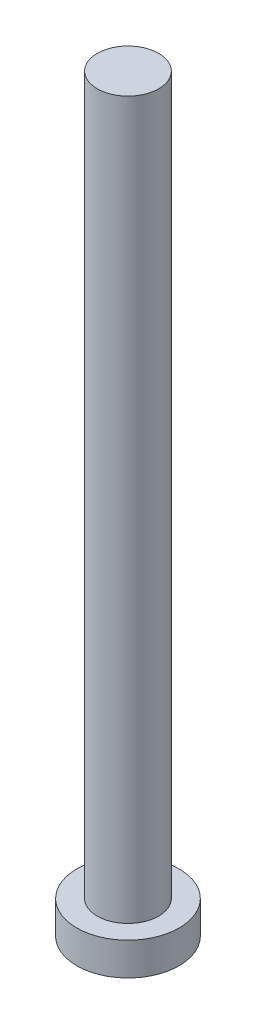
ISO-10303-21;
HEADER;
FILE_DESCRIPTION(('STEP AP214'),'2;1');
FILE_NAME('part.step','',(''),(''),'','','');
FILE_SCHEMA(('AUTOMOTIVE_DESIGN { 1 0 10303 214 1 1 1 1 }'));
ENDSEC;
DATA;
#1=APPLICATION_CONTEXT('core data for automotive mechanical design processes');
#2=APPLICATION_PROTOCOL_DEFINITION('international standard','automotive_design',2000,#1);
#3=PRODUCT_CONTEXT('',#1,'mechanical');
#4=PRODUCT('Part','Part','',(#3));
#5=PRODUCT_RELATED_PRODUCT_CATEGORY('part','',(#4));
#6=PRODUCT_DEFINITION_FORMATION('','',#4);
#7=PRODUCT_DEFINITION_CONTEXT('part definition',#1,'design');
#8=PRODUCT_DEFINITION('design','',#6,#7);
#9=PRODUCT_DEFINITION_SHAPE('','',#8);
#10=(LENGTH_UNIT() NAMED_UNIT(*) SI_UNIT(.MILLI.,.METRE.));
#11=(NAMED_UNIT(*) PLANE_ANGLE_UNIT() SI_UNIT($,.RADIAN.));
#12=(NAMED_UNIT(*) SI_UNIT($,.STERADIAN.) SOLID_ANGLE_UNIT());
#13=UNCERTAINTY_MEASURE_WITH_UNIT(LENGTH_MEASURE(1.E-05),#10,'distance_accuracy_value','');
#14=(GEOMETRIC_REPRESENTATION_CONTEXT(3) GLOBAL_UNCERTAINTY_ASSIGNED_CONTEXT((#13)) GLOBAL_UNIT_ASSIGNED_CONTEXT((#10,
#11,#12)) REPRESENTATION_CONTEXT('',''));
#15=CARTESIAN_POINT('',(0.,0.,0.));
#16=DIRECTION('',(0.,0.,1.));
#17=DIRECTION('',(1.,0.,0.));
#18=AXIS2_PLACEMENT_3D('',#15,#16,#17);
#19=CARTESIAN_POINT('',(0.,0.,0.));
#20=DIRECTION('',(0.,1.,0.));
#21=DIRECTION('',(0.,0.,1.));
#22=AXIS2_PLACEMENT_3D('',#19,#20,#21);
#23=PLANE('',#22);
#24=CARTESIAN_POINT('',(0.,0.,0.));
#25=DIRECTION('',(0.,1.,0.));
#26=DIRECTION('',(0.,0.,1.));
#27=AXIS2_PLACEMENT_3D('',#24,#25,#26);
#28=CIRCLE('',#27,2.5);
#29=CARTESIAN_POINT('',(0.,0.,2.5));
#30=VERTEX_POINT('',#29);
#31=EDGE_CURVE('E39',#30,#30,#28,.T.);
#32=ORIENTED_EDGE('',*,*,#31,.F.);
#33=EDGE_LOOP('',(#32));
#34=FACE_BOUND('',#33,.T.);
#35=CARTESIAN_POINT('',(1.,0.,1.));
#36=DIRECTION('',(0.,1.,0.));
#37=DIRECTION('',(0.,0.,-1.));
#38=AXIS2_PLACEMENT_3D('',#35,#36,#37);
#39=CIRCLE('',#38,0.5);
#40=CARTESIAN_POINT('',(1.,0.,0.5));
#41=VERTEX_POINT('',#40);
#42=CARTESIAN_POINT('',(0.5,0.,1.));
#43=VERTEX_POINT('',#42);
#44=EDGE_CURVE('E186',#41,#43,#39,.T.);
#45=ORIENTED_EDGE('',*,*,#44,.F.);
#46=DIRECTION('',(-1.,0.,0.));
#47=VECTOR('',#46,1.);
#48=CARTESIAN_POINT('',(1.,0.,0.5));
#49=LINE('',#48,#47);
#50=CARTESIAN_POINT('',(1.75,0.,0.5));
#51=VERTEX_POINT('',#50);
#52=EDGE_CURVE('E52',#51,#41,#49,.T.);
#53=ORIENTED_EDGE('',*,*,#52,.F.);
#54=DIRECTION('',(0.,0.,1.));
#55=VECTOR('',#54,1.);
#56=CARTESIAN_POINT('',(1.75,0.,-0.5));
#57=LINE('',#56,#55);
#58=CARTESIAN_POINT('',(1.75,0.,-0.5));
#59=VERTEX_POINT('',#58);
#60=EDGE_CURVE('E225',#59,#51,#57,.T.);
#61=ORIENTED_EDGE('',*,*,#60,.F.);
#62=DIRECTION('',(1.,0.,0.));
#63=VECTOR('',#62,1.);
#64=CARTESIAN_POINT('',(1.,0.,-0.5));
#65=LINE('',#64,#63);
#66=CARTESIAN_POINT('',(1.,0.,-0.5));
#67=VERTEX_POINT('',#66);
#68=EDGE_CURVE('E223',#67,#59,#65,.T.);
#69=ORIENTED_EDGE('',*,*,#68,.F.);
#70=CARTESIAN_POINT('',(1.,0.,-1.));
#71=DIRECTION('',(0.,1.,0.));
#72=DIRECTION('',(0.,0.,-1.));
#73=AXIS2_PLACEMENT_3D('',#70,#71,#72);
#74=CIRCLE('',#73,0.5);
#75=CARTESIAN_POINT('',(0.5,0.,-1.));
#76=VERTEX_POINT('',#75);
#77=EDGE_CURVE('E160',#76,#67,#74,.T.);
#78=ORIENTED_EDGE('',*,*,#77,.F.);
#79=DIRECTION('',(0.,0.,1.));
#80=VECTOR('',#79,1.);
#81=CARTESIAN_POINT('',(0.5,0.,-1.75));
#82=LINE('',#81,#80);
#83=CARTESIAN_POINT('',(0.5,0.,-1.75));
#84=VERTEX_POINT('',#83);
#85=EDGE_CURVE('E219',#84,#76,#82,.T.);
#86=ORIENTED_EDGE('',*,*,#85,.F.);
#87=DIRECTION('',(1.,0.,0.));
#88=VECTOR('',#87,1.);
#89=CARTESIAN_POINT('',(-0.5,0.,-1.75));
#90=LINE('',#89,#88);
#91=CARTESIAN_POINT('',(-0.5,0.,-1.75));
#92=VERTEX_POINT('',#91);
#93=EDGE_CURVE('E216',#92,#84,#90,.T.);
#94=ORIENTED_EDGE('',*,*,#93,.F.);
#95=DIRECTION('',(0.,0.,-1.));
#96=VECTOR('',#95,1.);
#97=CARTESIAN_POINT('',(-0.5,0.,-1.75));
#98=LINE('',#97,#96);
#99=CARTESIAN_POINT('',(-0.5,0.,-1.));
#100=VERTEX_POINT('',#99);
#101=EDGE_CURVE('E213',#100,#92,#98,.T.);
#102=ORIENTED_EDGE('',*,*,#101,.F.);
#103=CARTESIAN_POINT('',(-1.,0.,-1.));
#104=DIRECTION('',(0.,1.,0.));
#105=DIRECTION('',(0.,0.,-1.));
#106=AXIS2_PLACEMENT_3D('',#103,#104,#105);
#107=CIRCLE('',#106,0.5);
#108=CARTESIAN_POINT('',(-1.,0.,-0.5));
#109=VERTEX_POINT('',#108);
#110=EDGE_CURVE('E210',#109,#100,#107,.T.);
#111=ORIENTED_EDGE('',*,*,#110,.F.);
#112=DIRECTION('',(1.,0.,0.));
#113=VECTOR('',#112,1.);
#114=CARTESIAN_POINT('',(-1.75,0.,-0.5));
#115=LINE('',#114,#113);
#116=CARTESIAN_POINT('',(-1.75,0.,-0.5));
#117=VERTEX_POINT('',#116);
#118=EDGE_CURVE('E207',#117,#109,#115,.T.);
#119=ORIENTED_EDGE('',*,*,#118,.F.);
#120=DIRECTION('',(0.,0.,-1.));
#121=VECTOR('',#120,1.);
#122=CARTESIAN_POINT('',(-1.75,0.,-0.5));
#123=LINE('',#122,#121);
#124=CARTESIAN_POINT('',(-1.75,0.,0.5));
#125=VERTEX_POINT('',#124);
#126=EDGE_CURVE('E204',#125,#117,#123,.T.);
#127=ORIENTED_EDGE('',*,*,#126,.F.);
#128=DIRECTION('',(-1.,0.,0.));
#129=VECTOR('',#128,1.);
#130=CARTESIAN_POINT('',(-1.75,0.,0.5));
#131=LINE('',#130,#129);
#132=CARTESIAN_POINT('',(-1.,0.,0.5));
#133=VERTEX_POINT('',#132);
#134=EDGE_CURVE('E201',#133,#125,#131,.T.);
#135=ORIENTED_EDGE('',*,*,#134,.F.);
#136=CARTESIAN_POINT('',(-1.,0.,1.));
#137=DIRECTION('',(0.,1.,0.));
#138=DIRECTION('',(0.,0.,1.));
#139=AXIS2_PLACEMENT_3D('',#136,#137,#138);
#140=CIRCLE('',#139,0.5);
#141=CARTESIAN_POINT('',(-0.5,0.,1.));
#142=VERTEX_POINT('',#141);
#143=EDGE_CURVE('E198',#142,#133,#140,.T.);
#144=ORIENTED_EDGE('',*,*,#143,.F.);
#145=DIRECTION('',(0.,0.,-1.));
#146=VECTOR('',#145,1.);
#147=CARTESIAN_POINT('',(-0.5,0.,1.));
#148=LINE('',#147,#146);
#149=CARTESIAN_POINT('',(-0.5,0.,1.75));
#150=VERTEX_POINT('',#149);
#151=EDGE_CURVE('E195',#150,#142,#148,.T.);
#152=ORIENTED_EDGE('',*,*,#151,.F.);
#153=DIRECTION('',(-1.,0.,0.));
#154=VECTOR('',#153,1.);
#155=CARTESIAN_POINT('',(-0.5,0.,1.75));
#156=LINE('',#155,#154);
#157=CARTESIAN_POINT('',(0.5,0.,1.75));
#158=VERTEX_POINT('',#157);
#159=EDGE_CURVE('E192',#158,#150,#156,.T.);
#160=ORIENTED_EDGE('',*,*,#159,.F.);
#161=DIRECTION('',(0.,0.,1.));
#162=VECTOR('',#161,1.);
#163=CARTESIAN_POINT('',(0.5,0.,1.));
#164=LINE('',#163,#162);
#165=EDGE_CURVE('E189',#43,#158,#164,.T.);
#166=ORIENTED_EDGE('',*,*,#165,.F.);
#167=EDGE_LOOP('',(#45,#53,#61,#69,#78,#86,#94,#102,#111,#119,#127,#135,#144,#152,#160,#166));
#168=FACE_BOUND('',#167,.T.);
#169=ADVANCED_FACE('F35',(#34,#168),#23,.F.);
#170=CARTESIAN_POINT('',(0.,1.6,0.));
#171=DIRECTION('',(0.,-1.,0.));
#172=DIRECTION('',(0.,0.,-1.));
#173=AXIS2_PLACEMENT_3D('',#170,#171,#172);
#174=CYLINDRICAL_SURFACE('',#173,2.5);
#175=CARTESIAN_POINT('',(0.,1.6,0.));
#176=DIRECTION('',(0.,1.,0.));
#177=DIRECTION('',(0.,0.,1.));
#178=AXIS2_PLACEMENT_3D('',#175,#176,#177);
#179=CIRCLE('',#178,2.5);
#180=CARTESIAN_POINT('',(0.,1.6,2.5));
#181=VERTEX_POINT('',#180);
#182=EDGE_CURVE('E44',#181,#181,#179,.T.);
#183=ORIENTED_EDGE('',*,*,#182,.F.);
#184=EDGE_LOOP('',(#183));
#185=FACE_BOUND('',#184,.T.);
#186=ORIENTED_EDGE('',*,*,#31,.T.);
#187=EDGE_LOOP('',(#186));
#188=FACE_BOUND('',#187,.T.);
#189=ADVANCED_FACE('F37',(#185,#188),#174,.T.);
#190=CARTESIAN_POINT('',(0.,1.6,0.));
#191=DIRECTION('',(0.,1.,0.));
#192=DIRECTION('',(0.,0.,1.));
#193=AXIS2_PLACEMENT_3D('',#190,#191,#192);
#194=PLANE('',#193);
#195=CARTESIAN_POINT('',(0.,1.6,0.));
#196=DIRECTION('',(0.,1.,0.));
#197=DIRECTION('',(0.,0.,1.));
#198=AXIS2_PLACEMENT_3D('',#195,#196,#197);
#199=CIRCLE('',#198,1.5);
#200=CARTESIAN_POINT('',(0.,1.6,1.5));
#201=VERTEX_POINT('',#200);
#202=EDGE_CURVE('E11',#201,#201,#199,.T.);
#203=ORIENTED_EDGE('',*,*,#202,.F.);
#204=EDGE_LOOP('',(#203));
#205=FACE_BOUND('',#204,.T.);
#206=ORIENTED_EDGE('',*,*,#182,.T.);
#207=EDGE_LOOP('',(#206));
#208=FACE_BOUND('',#207,.T.);
#209=ADVANCED_FACE('F374',(#205,#208),#194,.T.);
#210=CARTESIAN_POINT('',(0.,36.6,0.));
#211=DIRECTION('',(0.,-1.,0.));
#212=DIRECTION('',(0.,0.,-1.));
#213=AXIS2_PLACEMENT_3D('',#210,#211,#212);
#214=CYLINDRICAL_SURFACE('',#213,1.5);
#215=CARTESIAN_POINT('',(0.,36.6,0.));
#216=DIRECTION('',(0.,1.,0.));
#217=DIRECTION('',(0.,0.,1.));
#218=AXIS2_PLACEMENT_3D('',#215,#216,#217);
#219=CIRCLE('',#218,1.5);
#220=CARTESIAN_POINT('',(0.,36.6,1.5));
#221=VERTEX_POINT('',#220);
#222=EDGE_CURVE('E229',#221,#221,#219,.T.);
#223=ORIENTED_EDGE('',*,*,#222,.F.);
#224=EDGE_LOOP('',(#223));
#225=FACE_BOUND('',#224,.T.);
#226=ORIENTED_EDGE('',*,*,#202,.T.);
#227=EDGE_LOOP('',(#226));
#228=FACE_BOUND('',#227,.T.);
#229=ADVANCED_FACE('F370',(#225,#228),#214,.T.);
#230=CARTESIAN_POINT('',(0.,36.6,0.));
#231=DIRECTION('',(0.,1.,0.));
#232=DIRECTION('',(0.,0.,1.));
#233=AXIS2_PLACEMENT_3D('',#230,#231,#232);
#234=PLANE('',#233);
#235=ORIENTED_EDGE('',*,*,#222,.T.);
#236=EDGE_LOOP('',(#235));
#237=FACE_BOUND('',#236,.T.);
#238=ADVANCED_FACE('F320',(#237),#234,.T.);
#239=CARTESIAN_POINT('',(1.,1.,0.5));
#240=DIRECTION('',(0.,0.,1.));
#241=DIRECTION('',(1.,0.,0.));
#242=AXIS2_PLACEMENT_3D('',#239,#240,#241);
#243=PLANE('',#242);
#244=ORIENTED_EDGE('',*,*,#52,.T.);
#245=DIRECTION('',(0.,-1.,0.));
#246=VECTOR('',#245,1.);
#247=CARTESIAN_POINT('',(1.,1.,0.5));
#248=LINE('',#247,#246);
#249=CARTESIAN_POINT('',(1.,1.,0.5));
#250=VERTEX_POINT('',#249);
#251=EDGE_CURVE('E112',#250,#41,#248,.T.);
#252=ORIENTED_EDGE('',*,*,#251,.F.);
#253=DIRECTION('',(-1.,0.,0.));
#254=VECTOR('',#253,1.);
#255=CARTESIAN_POINT('',(1.,1.,0.5));
#256=LINE('',#255,#254);
#257=CARTESIAN_POINT('',(1.75,1.,0.5));
#258=VERTEX_POINT('',#257);
#259=EDGE_CURVE('E227',#258,#250,#256,.T.);
#260=ORIENTED_EDGE('',*,*,#259,.F.);
#261=DIRECTION('',(0.,-1.,0.));
#262=VECTOR('',#261,1.);
#263=CARTESIAN_POINT('',(1.75,1.,0.5));
#264=LINE('',#263,#262);
#265=EDGE_CURVE('E60',#258,#51,#264,.T.);
#266=ORIENTED_EDGE('',*,*,#265,.T.);
#267=EDGE_LOOP('',(#244,#252,#260,#266));
#268=FACE_BOUND('',#267,.T.);
#269=ADVANCED_FACE('F313',(#268),#243,.F.);
#270=CARTESIAN_POINT('',(1.75,1.,-0.5));
#271=DIRECTION('',(1.,0.,0.));
#272=DIRECTION('',(0.,0.,-1.));
#273=AXIS2_PLACEMENT_3D('',#270,#271,#272);
#274=PLANE('',#273);
#275=ORIENTED_EDGE('',*,*,#60,.T.);
#276=ORIENTED_EDGE('',*,*,#265,.F.);
#277=DIRECTION('',(0.,0.,1.));
#278=VECTOR('',#277,1.);
#279=CARTESIAN_POINT('',(1.75,1.,-0.5));
#280=LINE('',#279,#278);
#281=CARTESIAN_POINT('',(1.75,1.,-0.5));
#282=VERTEX_POINT('',#281);
#283=EDGE_CURVE('E172',#282,#258,#280,.T.);
#284=ORIENTED_EDGE('',*,*,#283,.F.);
#285=DIRECTION('',(0.,-1.,0.));
#286=VECTOR('',#285,1.);
#287=CARTESIAN_POINT('',(1.75,1.,-0.5));
#288=LINE('',#287,#286);
#289=EDGE_CURVE('E164',#282,#59,#288,.T.);
#290=ORIENTED_EDGE('',*,*,#289,.T.);
#291=EDGE_LOOP('',(#275,#276,#284,#290));
#292=FACE_BOUND('',#291,.T.);
#293=ADVANCED_FACE('F311',(#292),#274,.F.);
#294=CARTESIAN_POINT('',(1.,1.,-0.5));
#295=DIRECTION('',(0.,0.,-1.));
#296=DIRECTION('',(-1.,0.,0.));
#297=AXIS2_PLACEMENT_3D('',#294,#295,#296);
#298=PLANE('',#297);
#299=ORIENTED_EDGE('',*,*,#68,.T.);
#300=ORIENTED_EDGE('',*,*,#289,.F.);
#301=DIRECTION('',(1.,0.,0.));
#302=VECTOR('',#301,1.);
#303=CARTESIAN_POINT('',(1.,1.,-0.5));
#304=LINE('',#303,#302);
#305=CARTESIAN_POINT('',(1.,1.,-0.5));
#306=VERTEX_POINT('',#305);
#307=EDGE_CURVE('E168',#306,#282,#304,.T.);
#308=ORIENTED_EDGE('',*,*,#307,.F.);
#309=DIRECTION('',(0.,-1.,0.));
#310=VECTOR('',#309,1.);
#311=CARTESIAN_POINT('',(1.,1.,-0.5));
#312=LINE('',#311,#310);
#313=EDGE_CURVE('E153',#306,#67,#312,.T.);
#314=ORIENTED_EDGE('',*,*,#313,.T.);
#315=EDGE_LOOP('',(#299,#300,#308,#314));
#316=FACE_BOUND('',#315,.T.);
#317=ADVANCED_FACE('F169',(#316),#298,.F.);
#318=CARTESIAN_POINT('',(1.,1.,-1.));
#319=DIRECTION('',(0.,-1.,0.));
#320=DIRECTION('',(0.,0.,-1.));
#321=AXIS2_PLACEMENT_3D('',#318,#319,#320);
#322=CYLINDRICAL_SURFACE('',#321,0.5);
#323=ORIENTED_EDGE('',*,*,#77,.T.);
#324=ORIENTED_EDGE('',*,*,#313,.F.);
#325=CARTESIAN_POINT('',(1.,1.,-1.));
#326=DIRECTION('',(0.,1.,0.));
#327=DIRECTION('',(0.,0.,-1.));
#328=AXIS2_PLACEMENT_3D('',#325,#326,#327);
#329=CIRCLE('',#328,0.5);
#330=CARTESIAN_POINT('',(0.5,1.,-1.));
#331=VERTEX_POINT('',#330);
#332=EDGE_CURVE('E157',#331,#306,#329,.T.);
#333=ORIENTED_EDGE('',*,*,#332,.F.);
#334=DIRECTION('',(0.,-1.,0.));
#335=VECTOR('',#334,1.);
#336=CARTESIAN_POINT('',(0.5,1.,-1.));
#337=LINE('',#336,#335);
#338=EDGE_CURVE('E165',#331,#76,#337,.T.);
#339=ORIENTED_EDGE('',*,*,#338,.T.);
#340=EDGE_LOOP('',(#323,#324,#333,#339));
#341=FACE_BOUND('',#340,.T.);
#342=ADVANCED_FACE('F155',(#341),#322,.T.);
#343=CARTESIAN_POINT('',(0.5,1.,-1.75));
#344=DIRECTION('',(1.,0.,0.));
#345=DIRECTION('',(0.,0.,-1.));
#346=AXIS2_PLACEMENT_3D('',#343,#344,#345);
#347=PLANE('',#346);
#348=ORIENTED_EDGE('',*,*,#85,.T.);
#349=ORIENTED_EDGE('',*,*,#338,.F.);
#350=DIRECTION('',(0.,0.,1.));
#351=VECTOR('',#350,1.);
#352=CARTESIAN_POINT('',(0.5,1.,-1.75));
#353=LINE('',#352,#351);
#354=CARTESIAN_POINT('',(0.5,1.,-1.75));
#355=VERTEX_POINT('',#354);
#356=EDGE_CURVE('E178',#355,#331,#353,.T.);
#357=ORIENTED_EDGE('',*,*,#356,.F.);
#358=DIRECTION('',(0.,-1.,0.));
#359=VECTOR('',#358,1.);
#360=CARTESIAN_POINT('',(0.5,1.,-1.75));
#361=LINE('',#360,#359);
#362=EDGE_CURVE('E232',#355,#84,#361,.T.);
#363=ORIENTED_EDGE('',*,*,#362,.T.);
#364=EDGE_LOOP('',(#348,#349,#357,#363));
#365=FACE_BOUND('',#364,.T.);
#366=ADVANCED_FACE('F310',(#365),#347,.F.);
#367=CARTESIAN_POINT('',(-0.5,1.,-1.75));
#368=DIRECTION('',(0.,0.,-1.));
#369=DIRECTION('',(-1.,0.,0.));
#370=AXIS2_PLACEMENT_3D('',#367,#368,#369);
#371=PLANE('',#370);
#372=ORIENTED_EDGE('',*,*,#93,.T.);
#373=ORIENTED_EDGE('',*,*,#362,.F.);
#374=DIRECTION('',(1.,0.,0.));
#375=VECTOR('',#374,1.);
#376=CARTESIAN_POINT('',(-0.5,1.,-1.75));
#377=LINE('',#376,#375);
#378=CARTESIAN_POINT('',(-0.5,1.,-1.75));
#379=VERTEX_POINT('',#378);
#380=EDGE_CURVE('E180',#379,#355,#377,.T.);
#381=ORIENTED_EDGE('',*,*,#380,.F.);
#382=DIRECTION('',(0.,-1.,0.));
#383=VECTOR('',#382,1.);
#384=CARTESIAN_POINT('',(-0.5,1.,-1.75));
#385=LINE('',#384,#383);
#386=EDGE_CURVE('E234',#379,#92,#385,.T.);
#387=ORIENTED_EDGE('',*,*,#386,.T.);
#388=EDGE_LOOP('',(#372,#373,#381,#387));
#389=FACE_BOUND('',#388,.T.);
#390=ADVANCED_FACE('F306',(#389),#371,.F.);
#391=CARTESIAN_POINT('',(-0.5,1.,-1.75));
#392=DIRECTION('',(-1.,0.,0.));
#393=DIRECTION('',(0.,0.,1.));
#394=AXIS2_PLACEMENT_3D('',#391,#392,#393);
#395=PLANE('',#394);
#396=ORIENTED_EDGE('',*,*,#101,.T.);
#397=ORIENTED_EDGE('',*,*,#386,.F.);
#398=DIRECTION('',(0.,0.,-1.));
#399=VECTOR('',#398,1.);
#400=CARTESIAN_POINT('',(-0.5,1.,-1.75));
#401=LINE('',#400,#399);
#402=CARTESIAN_POINT('',(-0.5,1.,-1.));
#403=VERTEX_POINT('',#402);
#404=EDGE_CURVE('E301',#403,#379,#401,.T.);
#405=ORIENTED_EDGE('',*,*,#404,.F.);
#406=DIRECTION('',(0.,-1.,0.));
#407=VECTOR('',#406,1.);
#408=CARTESIAN_POINT('',(-0.5,1.,-1.));
#409=LINE('',#408,#407);
#410=EDGE_CURVE('E236',#403,#100,#409,.T.);
#411=ORIENTED_EDGE('',*,*,#410,.T.);
#412=EDGE_LOOP('',(#396,#397,#405,#411));
#413=FACE_BOUND('',#412,.T.);
#414=ADVANCED_FACE('F330',(#413),#395,.F.);
#415=CARTESIAN_POINT('',(-1.,1.,-1.));
#416=DIRECTION('',(0.,-1.,0.));
#417=DIRECTION('',(0.,0.,-1.));
#418=AXIS2_PLACEMENT_3D('',#415,#416,#417);
#419=CYLINDRICAL_SURFACE('',#418,0.5);
#420=ORIENTED_EDGE('',*,*,#110,.T.);
#421=ORIENTED_EDGE('',*,*,#410,.F.);
#422=CARTESIAN_POINT('',(-1.,1.,-1.));
#423=DIRECTION('',(0.,1.,0.));
#424=DIRECTION('',(0.,0.,-1.));
#425=AXIS2_PLACEMENT_3D('',#422,#423,#424);
#426=CIRCLE('',#425,0.5);
#427=CARTESIAN_POINT('',(-1.,1.,-0.5));
#428=VERTEX_POINT('',#427);
#429=EDGE_CURVE('E298',#428,#403,#426,.T.);
#430=ORIENTED_EDGE('',*,*,#429,.F.);
#431=DIRECTION('',(0.,-1.,0.));
#432=VECTOR('',#431,1.);
#433=CARTESIAN_POINT('',(-1.,1.,-0.5));
#434=LINE('',#433,#432);
#435=EDGE_CURVE('E238',#428,#109,#434,.T.);
#436=ORIENTED_EDGE('',*,*,#435,.T.);
#437=EDGE_LOOP('',(#420,#421,#430,#436));
#438=FACE_BOUND('',#437,.T.);
#439=ADVANCED_FACE('F333',(#438),#419,.T.);
#440=CARTESIAN_POINT('',(-1.75,1.,-0.5));
#441=DIRECTION('',(0.,0.,-1.));
#442=DIRECTION('',(-1.,0.,0.));
#443=AXIS2_PLACEMENT_3D('',#440,#441,#442);
#444=PLANE('',#443);
#445=ORIENTED_EDGE('',*,*,#118,.T.);
#446=ORIENTED_EDGE('',*,*,#435,.F.);
#447=DIRECTION('',(1.,0.,0.));
#448=VECTOR('',#447,1.);
#449=CARTESIAN_POINT('',(-1.75,1.,-0.5));
#450=LINE('',#449,#448);
#451=CARTESIAN_POINT('',(-1.75,1.,-0.5));
#452=VERTEX_POINT('',#451);
#453=EDGE_CURVE('E295',#452,#428,#450,.T.);
#454=ORIENTED_EDGE('',*,*,#453,.F.);
#455=DIRECTION('',(0.,-1.,0.));
#456=VECTOR('',#455,1.);
#457=CARTESIAN_POINT('',(-1.75,1.,-0.5));
#458=LINE('',#457,#456);
#459=EDGE_CURVE('E240',#452,#117,#458,.T.);
#460=ORIENTED_EDGE('',*,*,#459,.T.);
#461=EDGE_LOOP('',(#445,#446,#454,#460));
#462=FACE_BOUND('',#461,.T.);
#463=ADVANCED_FACE('F337',(#462),#444,.F.);
#464=CARTESIAN_POINT('',(-1.75,1.,-0.5));
#465=DIRECTION('',(-1.,0.,0.));
#466=DIRECTION('',(0.,0.,1.));
#467=AXIS2_PLACEMENT_3D('',#464,#465,#466);
#468=PLANE('',#467);
#469=ORIENTED_EDGE('',*,*,#126,.T.);
#470=ORIENTED_EDGE('',*,*,#459,.F.);
#471=DIRECTION('',(0.,0.,-1.));
#472=VECTOR('',#471,1.);
#473=CARTESIAN_POINT('',(-1.75,1.,-0.5));
#474=LINE('',#473,#472);
#475=CARTESIAN_POINT('',(-1.75,1.,0.5));
#476=VERTEX_POINT('',#475);
#477=EDGE_CURVE('E292',#476,#452,#474,.T.);
#478=ORIENTED_EDGE('',*,*,#477,.F.);
#479=DIRECTION('',(0.,-1.,0.));
#480=VECTOR('',#479,1.);
#481=CARTESIAN_POINT('',(-1.75,1.,0.5));
#482=LINE('',#481,#480);
#483=EDGE_CURVE('E242',#476,#125,#482,.T.);
#484=ORIENTED_EDGE('',*,*,#483,.T.);
#485=EDGE_LOOP('',(#469,#470,#478,#484));
#486=FACE_BOUND('',#485,.T.);
#487=ADVANCED_FACE('F341',(#486),#468,.F.);
#488=CARTESIAN_POINT('',(-1.75,1.,0.5));
#489=DIRECTION('',(0.,0.,1.));
#490=DIRECTION('',(1.,0.,0.));
#491=AXIS2_PLACEMENT_3D('',#488,#489,#490);
#492=PLANE('',#491);
#493=ORIENTED_EDGE('',*,*,#134,.T.);
#494=ORIENTED_EDGE('',*,*,#483,.F.);
#495=DIRECTION('',(-1.,0.,0.));
#496=VECTOR('',#495,1.);
#497=CARTESIAN_POINT('',(-1.75,1.,0.5));
#498=LINE('',#497,#496);
#499=CARTESIAN_POINT('',(-1.,1.,0.5));
#500=VERTEX_POINT('',#499);
#501=EDGE_CURVE('E289',#500,#476,#498,.T.);
#502=ORIENTED_EDGE('',*,*,#501,.F.);
#503=DIRECTION('',(0.,-1.,0.));
#504=VECTOR('',#503,1.);
#505=CARTESIAN_POINT('',(-1.,1.,0.5));
#506=LINE('',#505,#504);
#507=EDGE_CURVE('E244',#500,#133,#506,.T.);
#508=ORIENTED_EDGE('',*,*,#507,.T.);
#509=EDGE_LOOP('',(#493,#494,#502,#508));
#510=FACE_BOUND('',#509,.T.);
#511=ADVANCED_FACE('F345',(#510),#492,.F.);
#512=CARTESIAN_POINT('',(-1.,1.,1.));
#513=DIRECTION('',(0.,-1.,0.));
#514=DIRECTION('',(0.,0.,-1.));
#515=AXIS2_PLACEMENT_3D('',#512,#513,#514);
#516=CYLINDRICAL_SURFACE('',#515,0.5);
#517=ORIENTED_EDGE('',*,*,#143,.T.);
#518=ORIENTED_EDGE('',*,*,#507,.F.);
#519=CARTESIAN_POINT('',(-1.,1.,1.));
#520=DIRECTION('',(0.,1.,0.));
#521=DIRECTION('',(0.,0.,1.));
#522=AXIS2_PLACEMENT_3D('',#519,#520,#521);
#523=CIRCLE('',#522,0.5);
#524=CARTESIAN_POINT('',(-0.5,1.,1.));
#525=VERTEX_POINT('',#524);
#526=EDGE_CURVE('E286',#525,#500,#523,.T.);
#527=ORIENTED_EDGE('',*,*,#526,.F.);
#528=DIRECTION('',(0.,-1.,0.));
#529=VECTOR('',#528,1.);
#530=CARTESIAN_POINT('',(-0.5,1.,1.));
#531=LINE('',#530,#529);
#532=EDGE_CURVE('E246',#525,#142,#531,.T.);
#533=ORIENTED_EDGE('',*,*,#532,.T.);
#534=EDGE_LOOP('',(#517,#518,#527,#533));
#535=FACE_BOUND('',#534,.T.);
#536=ADVANCED_FACE('F349',(#535),#516,.T.);
#537=CARTESIAN_POINT('',(-0.5,1.,1.));
#538=DIRECTION('',(-1.,0.,0.));
#539=DIRECTION('',(0.,0.,1.));
#540=AXIS2_PLACEMENT_3D('',#537,#538,#539);
#541=PLANE('',#540);
#542=ORIENTED_EDGE('',*,*,#151,.T.);
#543=ORIENTED_EDGE('',*,*,#532,.F.);
#544=DIRECTION('',(0.,0.,-1.));
#545=VECTOR('',#544,1.);
#546=CARTESIAN_POINT('',(-0.5,1.,1.));
#547=LINE('',#546,#545);
#548=CARTESIAN_POINT('',(-0.5,1.,1.75));
#549=VERTEX_POINT('',#548);
#550=EDGE_CURVE('E283',#549,#525,#547,.T.);
#551=ORIENTED_EDGE('',*,*,#550,.F.);
#552=DIRECTION('',(0.,-1.,0.));
#553=VECTOR('',#552,1.);
#554=CARTESIAN_POINT('',(-0.5,1.,1.75));
#555=LINE('',#554,#553);
#556=EDGE_CURVE('E248',#549,#150,#555,.T.);
#557=ORIENTED_EDGE('',*,*,#556,.T.);
#558=EDGE_LOOP('',(#542,#543,#551,#557));
#559=FACE_BOUND('',#558,.T.);
#560=ADVANCED_FACE('F353',(#559),#541,.F.);
#561=CARTESIAN_POINT('',(-0.5,1.,1.75));
#562=DIRECTION('',(0.,0.,1.));
#563=DIRECTION('',(1.,0.,0.));
#564=AXIS2_PLACEMENT_3D('',#561,#562,#563);
#565=PLANE('',#564);
#566=ORIENTED_EDGE('',*,*,#159,.T.);
#567=ORIENTED_EDGE('',*,*,#556,.F.);
#568=DIRECTION('',(-1.,0.,0.));
#569=VECTOR('',#568,1.);
#570=CARTESIAN_POINT('',(-0.5,1.,1.75));
#571=LINE('',#570,#569);
#572=CARTESIAN_POINT('',(0.5,1.,1.75));
#573=VERTEX_POINT('',#572);
#574=EDGE_CURVE('E280',#573,#549,#571,.T.);
#575=ORIENTED_EDGE('',*,*,#574,.F.);
#576=DIRECTION('',(0.,-1.,0.));
#577=VECTOR('',#576,1.);
#578=CARTESIAN_POINT('',(0.5,1.,1.75));
#579=LINE('',#578,#577);
#580=EDGE_CURVE('E250',#573,#158,#579,.T.);
#581=ORIENTED_EDGE('',*,*,#580,.T.);
#582=EDGE_LOOP('',(#566,#567,#575,#581));
#583=FACE_BOUND('',#582,.T.);
#584=ADVANCED_FACE('F357',(#583),#565,.F.);
#585=CARTESIAN_POINT('',(0.5,1.,1.));
#586=DIRECTION('',(1.,0.,0.));
#587=DIRECTION('',(0.,0.,-1.));
#588=AXIS2_PLACEMENT_3D('',#585,#586,#587);
#589=PLANE('',#588);
#590=ORIENTED_EDGE('',*,*,#165,.T.);
#591=ORIENTED_EDGE('',*,*,#580,.F.);
#592=DIRECTION('',(0.,0.,1.));
#593=VECTOR('',#592,1.);
#594=CARTESIAN_POINT('',(0.5,1.,1.));
#595=LINE('',#594,#593);
#596=CARTESIAN_POINT('',(0.5,1.,1.));
#597=VERTEX_POINT('',#596);
#598=EDGE_CURVE('E275',#597,#573,#595,.T.);
#599=ORIENTED_EDGE('',*,*,#598,.F.);
#600=DIRECTION('',(0.,-1.,0.));
#601=VECTOR('',#600,1.);
#602=CARTESIAN_POINT('',(0.5,1.,1.));
#603=LINE('',#602,#601);
#604=EDGE_CURVE('E252',#597,#43,#603,.T.);
#605=ORIENTED_EDGE('',*,*,#604,.T.);
#606=EDGE_LOOP('',(#590,#591,#599,#605));
#607=FACE_BOUND('',#606,.T.);
#608=ADVANCED_FACE('F361',(#607),#589,.F.);
#609=CARTESIAN_POINT('',(1.,1.,1.));
#610=DIRECTION('',(0.,-1.,0.));
#611=DIRECTION('',(0.,0.,-1.));
#612=AXIS2_PLACEMENT_3D('',#609,#610,#611);
#613=CYLINDRICAL_SURFACE('',#612,0.5);
#614=ORIENTED_EDGE('',*,*,#44,.T.);
#615=ORIENTED_EDGE('',*,*,#604,.F.);
#616=CARTESIAN_POINT('',(1.,1.,1.));
#617=DIRECTION('',(0.,1.,0.));
#618=DIRECTION('',(0.,0.,-1.));
#619=AXIS2_PLACEMENT_3D('',#616,#617,#618);
#620=CIRCLE('',#619,0.5);
#621=EDGE_CURVE('E273',#250,#597,#620,.T.);
#622=ORIENTED_EDGE('',*,*,#621,.F.);
#623=ORIENTED_EDGE('',*,*,#251,.T.);
#624=EDGE_LOOP('',(#614,#615,#622,#623));
#625=FACE_BOUND('',#624,.T.);
#626=ADVANCED_FACE('F270',(#625),#613,.T.);
#627=CARTESIAN_POINT('',(1.,1.,-1.));
#628=DIRECTION('',(0.,-1.,0.));
#629=DIRECTION('',(0.,0.,-1.));
#630=AXIS2_PLACEMENT_3D('',#627,#628,#629);
#631=PLANE('',#630);
#632=ORIENTED_EDGE('',*,*,#259,.T.);
#633=ORIENTED_EDGE('',*,*,#621,.T.);
#634=ORIENTED_EDGE('',*,*,#598,.T.);
#635=ORIENTED_EDGE('',*,*,#574,.T.);
#636=ORIENTED_EDGE('',*,*,#550,.T.);
#637=ORIENTED_EDGE('',*,*,#526,.T.);
#638=ORIENTED_EDGE('',*,*,#501,.T.);
#639=ORIENTED_EDGE('',*,*,#477,.T.);
#640=ORIENTED_EDGE('',*,*,#453,.T.);
#641=ORIENTED_EDGE('',*,*,#429,.T.);
#642=ORIENTED_EDGE('',*,*,#404,.T.);
#643=ORIENTED_EDGE('',*,*,#380,.T.);
#644=ORIENTED_EDGE('',*,*,#356,.T.);
#645=ORIENTED_EDGE('',*,*,#332,.T.);
#646=ORIENTED_EDGE('',*,*,#307,.T.);
#647=ORIENTED_EDGE('',*,*,#283,.T.);
#648=EDGE_LOOP('',(#632,#633,#634,#635,#636,#637,#638,#639,#640,#641,#642,#643,#644,#645,#646,#647));
#649=FACE_BOUND('',#648,.T.);
#650=ADVANCED_FACE('F175',(#649),#631,.T.);
#651=CLOSED_SHELL('',(#169,#189,#209,#229,#238,#269,#293,#317,#342,#366,#390,#414,#439,#463,
#487,#511,#536,#560,#584,#608,#626,#650));
#652=MANIFOLD_SOLID_BREP('B2',#651);
#653=ADVANCED_BREP_SHAPE_REPRESENTATION('',(#18,#652),#14);
#654=SHAPE_DEFINITION_REPRESENTATION(#9,#653);
ENDSEC;
END-ISO-10303-21;
